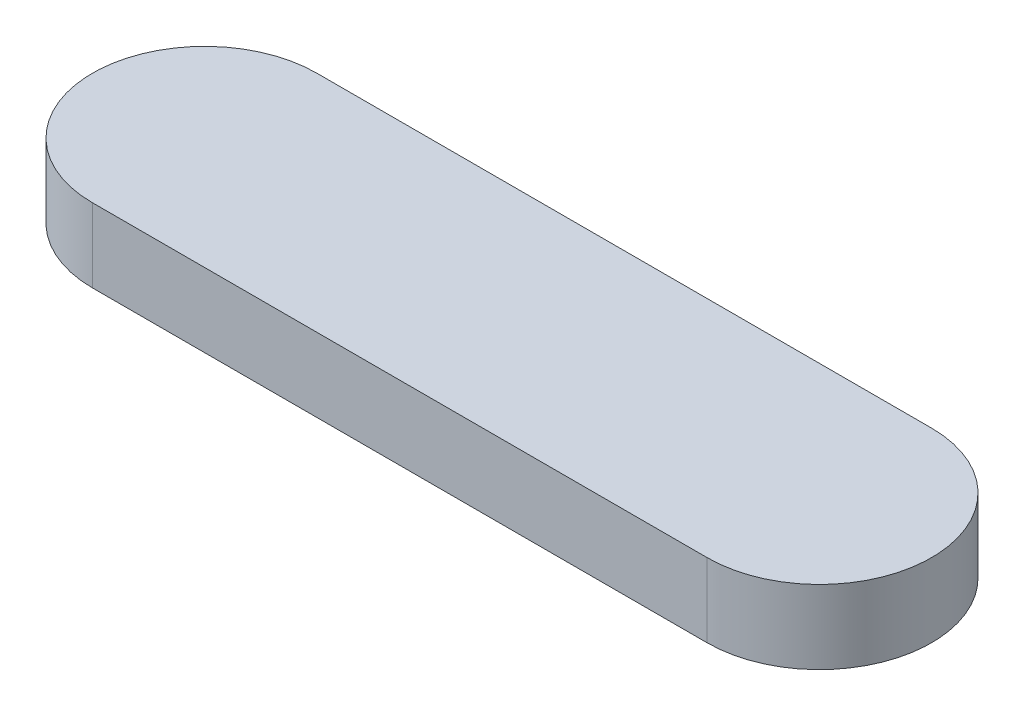
ISO-10303-21;
HEADER;
FILE_DESCRIPTION(('STEP AP214'),'2;1');
FILE_NAME('part.step','',(''),(''),'','','');
FILE_SCHEMA(('AUTOMOTIVE_DESIGN { 1 0 10303 214 1 1 1 1 }'));
ENDSEC;
DATA;
#1=APPLICATION_CONTEXT('core data for automotive mechanical design processes');
#2=APPLICATION_PROTOCOL_DEFINITION('international standard','automotive_design',2000,#1);
#3=PRODUCT_CONTEXT('',#1,'mechanical');
#4=PRODUCT('Part','Part','',(#3));
#5=PRODUCT_RELATED_PRODUCT_CATEGORY('part','',(#4));
#6=PRODUCT_DEFINITION_FORMATION('','',#4);
#7=PRODUCT_DEFINITION_CONTEXT('part definition',#1,'design');
#8=PRODUCT_DEFINITION('design','',#6,#7);
#9=PRODUCT_DEFINITION_SHAPE('','',#8);
#10=(LENGTH_UNIT() NAMED_UNIT(*) SI_UNIT(.MILLI.,.METRE.));
#11=(NAMED_UNIT(*) PLANE_ANGLE_UNIT() SI_UNIT($,.RADIAN.));
#12=(NAMED_UNIT(*) SI_UNIT($,.STERADIAN.) SOLID_ANGLE_UNIT());
#13=UNCERTAINTY_MEASURE_WITH_UNIT(LENGTH_MEASURE(1.E-05),#10,'distance_accuracy_value','');
#14=(GEOMETRIC_REPRESENTATION_CONTEXT(3) GLOBAL_UNCERTAINTY_ASSIGNED_CONTEXT((#13)) GLOBAL_UNIT_ASSIGNED_CONTEXT((#10,
#11,#12)) REPRESENTATION_CONTEXT('',''));
#15=CARTESIAN_POINT('',(0.,0.,0.));
#16=DIRECTION('',(0.,0.,1.));
#17=DIRECTION('',(1.,0.,0.));
#18=AXIS2_PLACEMENT_3D('',#15,#16,#17);
#19=CARTESIAN_POINT('',(204.999946966991,14.8,-14.9998823223305));
#20=DIRECTION('',(0.,-1.,0.));
#21=DIRECTION('',(0.,0.,-1.));
#22=AXIS2_PLACEMENT_3D('',#19,#20,#21);
#23=CYLINDRICAL_SURFACE('',#22,7.29999999999995);
#24=CARTESIAN_POINT('',(204.999946966991,10.,-14.9998823223305));
#25=DIRECTION('',(0.,1.,0.));
#26=DIRECTION('',(0.,0.,1.));
#27=AXIS2_PLACEMENT_3D('',#24,#25,#26);
#28=CIRCLE('',#27,7.29999999999995);
#29=CARTESIAN_POINT('',(204.999946966991,10.,-7.69988232233056));
#30=VERTEX_POINT('',#29);
#31=CARTESIAN_POINT('',(204.999946966991,10.,-22.2998823223305));
#32=VERTEX_POINT('',#31);
#33=EDGE_CURVE('E11',#30,#32,#28,.T.);
#34=ORIENTED_EDGE('',*,*,#33,.T.);
#35=DIRECTION('',(0.,-1.,0.));
#36=VECTOR('',#35,1.);
#37=CARTESIAN_POINT('',(204.999946966991,14.8,-22.2998823223305));
#38=LINE('',#37,#36);
#39=CARTESIAN_POINT('',(204.999946966991,14.8,-22.2998823223305));
#40=VERTEX_POINT('',#39);
#41=EDGE_CURVE('E110',#40,#32,#38,.T.);
#42=ORIENTED_EDGE('',*,*,#41,.F.);
#43=CARTESIAN_POINT('',(204.999946966991,14.8,-14.9998823223305));
#44=DIRECTION('',(0.,1.,0.));
#45=DIRECTION('',(0.,0.,1.));
#46=AXIS2_PLACEMENT_3D('',#43,#44,#45);
#47=CIRCLE('',#46,7.29999999999995);
#48=CARTESIAN_POINT('',(204.999946966991,14.8,-7.69988232233056));
#49=VERTEX_POINT('',#48);
#50=EDGE_CURVE('E43',#49,#40,#47,.T.);
#51=ORIENTED_EDGE('',*,*,#50,.F.);
#52=DIRECTION('',(0.,-1.,0.));
#53=VECTOR('',#52,1.);
#54=CARTESIAN_POINT('',(204.999946966991,14.8,-7.69988232233056));
#55=LINE('',#54,#53);
#56=EDGE_CURVE('E98',#49,#30,#55,.T.);
#57=ORIENTED_EDGE('',*,*,#56,.T.);
#58=EDGE_LOOP('',(#34,#42,#51,#57));
#59=FACE_BOUND('',#58,.T.);
#60=ADVANCED_FACE('F39',(#59),#23,.T.);
#61=CARTESIAN_POINT('',(164.999946966991,14.8,-22.2998823223305));
#62=DIRECTION('',(0.,0.,1.));
#63=DIRECTION('',(1.,0.,0.));
#64=AXIS2_PLACEMENT_3D('',#61,#62,#63);
#65=PLANE('',#64);
#66=DIRECTION('',(-1.,0.,0.));
#67=VECTOR('',#66,1.);
#68=CARTESIAN_POINT('',(164.999946966991,10.,-22.2998823223305));
#69=LINE('',#68,#67);
#70=CARTESIAN_POINT('',(164.999946966991,10.,-22.2998823223305));
#71=VERTEX_POINT('',#70);
#72=EDGE_CURVE('E49',#32,#71,#69,.T.);
#73=ORIENTED_EDGE('',*,*,#72,.T.);
#74=DIRECTION('',(0.,-1.,0.));
#75=VECTOR('',#74,1.);
#76=CARTESIAN_POINT('',(164.999946966991,14.8,-22.2998823223305));
#77=LINE('',#76,#75);
#78=CARTESIAN_POINT('',(164.999946966991,14.8,-22.2998823223305));
#79=VERTEX_POINT('',#78);
#80=EDGE_CURVE('E94',#79,#71,#77,.T.);
#81=ORIENTED_EDGE('',*,*,#80,.F.);
#82=DIRECTION('',(-1.,0.,0.));
#83=VECTOR('',#82,1.);
#84=CARTESIAN_POINT('',(164.999946966991,14.8,-22.2998823223305));
#85=LINE('',#84,#83);
#86=EDGE_CURVE('E73',#40,#79,#85,.T.);
#87=ORIENTED_EDGE('',*,*,#86,.F.);
#88=ORIENTED_EDGE('',*,*,#41,.T.);
#89=EDGE_LOOP('',(#73,#81,#87,#88));
#90=FACE_BOUND('',#89,.T.);
#91=ADVANCED_FACE('F113',(#90),#65,.F.);
#92=CARTESIAN_POINT('',(164.999946966991,14.8,-14.9998823223305));
#93=DIRECTION('',(0.,-1.,0.));
#94=DIRECTION('',(0.,0.,-1.));
#95=AXIS2_PLACEMENT_3D('',#92,#93,#94);
#96=CYLINDRICAL_SURFACE('',#95,7.29999999999995);
#97=CARTESIAN_POINT('',(164.999946966991,10.,-14.9998823223305));
#98=DIRECTION('',(0.,1.,0.));
#99=DIRECTION('',(0.,0.,1.));
#100=AXIS2_PLACEMENT_3D('',#97,#98,#99);
#101=CIRCLE('',#100,7.29999999999995);
#102=CARTESIAN_POINT('',(164.999946966991,10.,-7.69988232233056));
#103=VERTEX_POINT('',#102);
#104=EDGE_CURVE('E89',#71,#103,#101,.T.);
#105=ORIENTED_EDGE('',*,*,#104,.T.);
#106=DIRECTION('',(0.,-1.,0.));
#107=VECTOR('',#106,1.);
#108=CARTESIAN_POINT('',(164.999946966991,14.8,-7.69988232233056));
#109=LINE('',#108,#107);
#110=CARTESIAN_POINT('',(164.999946966991,14.8,-7.69988232233056));
#111=VERTEX_POINT('',#110);
#112=EDGE_CURVE('E92',#111,#103,#109,.T.);
#113=ORIENTED_EDGE('',*,*,#112,.F.);
#114=CARTESIAN_POINT('',(164.999946966991,14.8,-14.9998823223305));
#115=DIRECTION('',(0.,1.,0.));
#116=DIRECTION('',(0.,0.,1.));
#117=AXIS2_PLACEMENT_3D('',#114,#115,#116);
#118=CIRCLE('',#117,7.29999999999995);
#119=EDGE_CURVE('E106',#79,#111,#118,.T.);
#120=ORIENTED_EDGE('',*,*,#119,.F.);
#121=ORIENTED_EDGE('',*,*,#80,.T.);
#122=EDGE_LOOP('',(#105,#113,#120,#121));
#123=FACE_BOUND('',#122,.T.);
#124=ADVANCED_FACE('F90',(#123),#96,.T.);
#125=CARTESIAN_POINT('',(164.999946966991,14.8,-7.69988232233056));
#126=DIRECTION('',(0.,0.,-1.));
#127=DIRECTION('',(-1.,0.,0.));
#128=AXIS2_PLACEMENT_3D('',#125,#126,#127);
#129=PLANE('',#128);
#130=DIRECTION('',(1.,0.,0.));
#131=VECTOR('',#130,1.);
#132=CARTESIAN_POINT('',(164.999946966991,10.,-7.69988232233056));
#133=LINE('',#132,#131);
#134=EDGE_CURVE('E83',#103,#30,#133,.T.);
#135=ORIENTED_EDGE('',*,*,#134,.T.);
#136=ORIENTED_EDGE('',*,*,#56,.F.);
#137=DIRECTION('',(1.,0.,0.));
#138=VECTOR('',#137,1.);
#139=CARTESIAN_POINT('',(164.999946966991,14.8,-7.69988232233056));
#140=LINE('',#139,#138);
#141=EDGE_CURVE('E97',#111,#49,#140,.T.);
#142=ORIENTED_EDGE('',*,*,#141,.F.);
#143=ORIENTED_EDGE('',*,*,#112,.T.);
#144=EDGE_LOOP('',(#135,#136,#142,#143));
#145=FACE_BOUND('',#144,.T.);
#146=ADVANCED_FACE('F96',(#145),#129,.F.);
#147=CARTESIAN_POINT('',(204.999946966991,14.8,-14.9998823223305));
#148=DIRECTION('',(0.,1.,0.));
#149=DIRECTION('',(0.,0.,1.));
#150=AXIS2_PLACEMENT_3D('',#147,#148,#149);
#151=PLANE('',#150);
#152=ORIENTED_EDGE('',*,*,#50,.T.);
#153=ORIENTED_EDGE('',*,*,#86,.T.);
#154=ORIENTED_EDGE('',*,*,#119,.T.);
#155=ORIENTED_EDGE('',*,*,#141,.T.);
#156=EDGE_LOOP('',(#152,#153,#154,#155));
#157=FACE_BOUND('',#156,.T.);
#158=ADVANCED_FACE('F41',(#157),#151,.T.);
#159=CARTESIAN_POINT('',(204.999946966991,10.,-14.9998823223305));
#160=DIRECTION('',(0.,1.,0.));
#161=DIRECTION('',(0.,0.,1.));
#162=AXIS2_PLACEMENT_3D('',#159,#160,#161);
#163=PLANE('',#162);
#164=ORIENTED_EDGE('',*,*,#33,.F.);
#165=ORIENTED_EDGE('',*,*,#134,.F.);
#166=ORIENTED_EDGE('',*,*,#104,.F.);
#167=ORIENTED_EDGE('',*,*,#72,.F.);
#168=EDGE_LOOP('',(#164,#165,#166,#167));
#169=FACE_BOUND('',#168,.T.);
#170=ADVANCED_FACE('F100',(#169),#163,.F.);
#171=CLOSED_SHELL('',(#60,#91,#124,#146,#158,#170));
#172=MANIFOLD_SOLID_BREP('B2',#171);
#173=ADVANCED_BREP_SHAPE_REPRESENTATION('',(#18,#172),#14);
#174=SHAPE_DEFINITION_REPRESENTATION(#9,#173);
ENDSEC;
END-ISO-10303-21;
